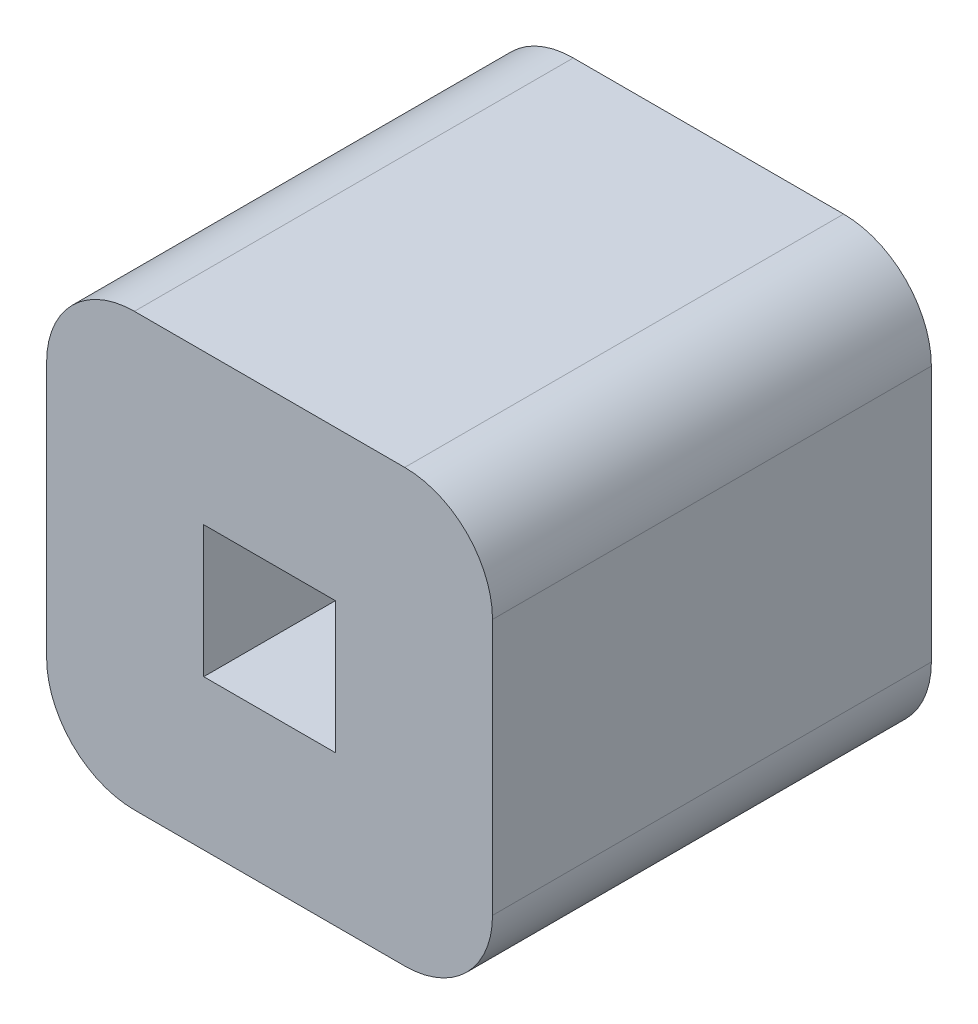
ISO-10303-21;
HEADER;
FILE_DESCRIPTION(('STEP AP214'),'2;1');
FILE_NAME('part.step','',(''),(''),'','','');
FILE_SCHEMA(('AUTOMOTIVE_DESIGN { 1 0 10303 214 1 1 1 1 }'));
ENDSEC;
DATA;
#1=APPLICATION_CONTEXT('core data for automotive mechanical design processes');
#2=APPLICATION_PROTOCOL_DEFINITION('international standard','automotive_design',2000,#1);
#3=PRODUCT_CONTEXT('',#1,'mechanical');
#4=PRODUCT('Part','Part','',(#3));
#5=PRODUCT_RELATED_PRODUCT_CATEGORY('part','',(#4));
#6=PRODUCT_DEFINITION_FORMATION('','',#4);
#7=PRODUCT_DEFINITION_CONTEXT('part definition',#1,'design');
#8=PRODUCT_DEFINITION('design','',#6,#7);
#9=PRODUCT_DEFINITION_SHAPE('','',#8);
#10=(LENGTH_UNIT() NAMED_UNIT(*) SI_UNIT(.MILLI.,.METRE.));
#11=(NAMED_UNIT(*) PLANE_ANGLE_UNIT() SI_UNIT($,.RADIAN.));
#12=(NAMED_UNIT(*) SI_UNIT($,.STERADIAN.) SOLID_ANGLE_UNIT());
#13=UNCERTAINTY_MEASURE_WITH_UNIT(LENGTH_MEASURE(1.E-05),#10,'distance_accuracy_value','');
#14=(GEOMETRIC_REPRESENTATION_CONTEXT(3) GLOBAL_UNCERTAINTY_ASSIGNED_CONTEXT((#13)) GLOBAL_UNIT_ASSIGNED_CONTEXT((#10,
#11,#12)) REPRESENTATION_CONTEXT('',''));
#15=CARTESIAN_POINT('',(0.,0.,0.));
#16=DIRECTION('',(0.,0.,1.));
#17=DIRECTION('',(1.,0.,0.));
#18=AXIS2_PLACEMENT_3D('',#15,#16,#17);
#19=CARTESIAN_POINT('',(0.570735714690618,-1.07588735959036,0.16337874015748));
#20=DIRECTION('',(0.,0.,-1.));
#21=DIRECTION('',(-1.,0.,0.));
#22=AXIS2_PLACEMENT_3D('',#19,#20,#21);
#23=PLANE('',#22);
#24=CARTESIAN_POINT('',(0.585420754060696,-0.946359800535238,0.16337874015748));
#25=DIRECTION('',(0.,0.,1.));
#26=DIRECTION('',(1.,0.,0.));
#27=AXIS2_PLACEMENT_3D('',#24,#25,#26);
#28=CIRCLE('',#27,0.0196850393700787);
#29=CARTESIAN_POINT('',(0.585420754060696,-0.966044839905316,0.16337874015748));
#30=VERTEX_POINT('',#29);
#31=CARTESIAN_POINT('',(0.565735714690617,-0.946359800535238,0.16337874015748));
#32=VERTEX_POINT('',#31);
#33=EDGE_CURVE('E159',#30,#32,#28,.F.);
#34=ORIENTED_EDGE('',*,*,#33,.F.);
#35=DIRECTION('',(1.,0.,0.));
#36=VECTOR('',#35,1.);
#37=CARTESIAN_POINT('',(0.649082171383531,-0.966044839905316,0.16337874015748));
#38=LINE('',#37,#36);
#39=CARTESIAN_POINT('',(0.646050675320538,-0.966044839905316,0.16337874015748));
#40=VERTEX_POINT('',#39);
#41=EDGE_CURVE('E134',#30,#40,#38,.T.);
#42=ORIENTED_EDGE('',*,*,#41,.T.);
#43=CARTESIAN_POINT('',(0.646050675320538,-0.946359800535238,0.16337874015748));
#44=DIRECTION('',(0.,0.,1.));
#45=DIRECTION('',(1.,0.,0.));
#46=AXIS2_PLACEMENT_3D('',#43,#44,#45);
#47=CIRCLE('',#46,0.0196850393700787);
#48=CARTESIAN_POINT('',(0.665735714690617,-0.946359800535238,0.16337874015748));
#49=VERTEX_POINT('',#48);
#50=EDGE_CURVE('E137',#49,#40,#47,.F.);
#51=ORIENTED_EDGE('',*,*,#50,.F.);
#52=DIRECTION('',(0.,1.,0.));
#53=VECTOR('',#52,1.);
#54=CARTESIAN_POINT('',(0.665735714690617,-0.781005469826576,0.16337874015748));
#55=LINE('',#54,#53);
#56=CARTESIAN_POINT('',(0.665735714690617,-0.888879485574608,0.16337874015748));
#57=VERTEX_POINT('',#56);
#58=EDGE_CURVE('E138',#49,#57,#55,.T.);
#59=ORIENTED_EDGE('',*,*,#58,.T.);
#60=CARTESIAN_POINT('',(0.646050675320538,-0.888879485574608,0.16337874015748));
#61=DIRECTION('',(0.,0.,-1.));
#62=DIRECTION('',(-1.,0.,0.));
#63=AXIS2_PLACEMENT_3D('',#60,#61,#62);
#64=CIRCLE('',#63,0.0196850393700787);
#65=CARTESIAN_POINT('',(0.646050675320538,-0.869194446204529,0.16337874015748));
#66=VERTEX_POINT('',#65);
#67=EDGE_CURVE('E164',#66,#57,#64,.T.);
#68=ORIENTED_EDGE('',*,*,#67,.F.);
#69=DIRECTION('',(1.,0.,0.));
#70=VECTOR('',#69,1.);
#71=CARTESIAN_POINT('',(0.649082171383531,-0.869194446204529,0.16337874015748));
#72=LINE('',#71,#70);
#73=CARTESIAN_POINT('',(0.585420754060696,-0.869194446204529,0.16337874015748));
#74=VERTEX_POINT('',#73);
#75=EDGE_CURVE('E143',#74,#66,#72,.T.);
#76=ORIENTED_EDGE('',*,*,#75,.F.);
#77=CARTESIAN_POINT('',(0.585420754060696,-0.888879485574608,0.16337874015748));
#78=DIRECTION('',(0.,0.,-1.));
#79=DIRECTION('',(-1.,0.,0.));
#80=AXIS2_PLACEMENT_3D('',#77,#78,#79);
#81=CIRCLE('',#80,0.0196850393700787);
#82=CARTESIAN_POINT('',(0.565735714690617,-0.888879485574608,0.16337874015748));
#83=VERTEX_POINT('',#82);
#84=EDGE_CURVE('E20',#83,#74,#81,.T.);
#85=ORIENTED_EDGE('',*,*,#84,.F.);
#86=DIRECTION('',(0.,1.,0.));
#87=VECTOR('',#86,1.);
#88=CARTESIAN_POINT('',(0.565735714690617,-0.917619643054923,0.16337874015748));
#89=LINE('',#88,#87);
#90=EDGE_CURVE('E84',#83,#32,#89,.F.);
#91=ORIENTED_EDGE('',*,*,#90,.T.);
#92=EDGE_LOOP('',(#34,#42,#51,#59,#68,#76,#85,#91));
#93=FACE_BOUND('',#92,.T.);
#94=DIRECTION('',(0.,1.,0.));
#95=VECTOR('',#94,1.);
#96=CARTESIAN_POINT('',(0.600971935163058,-0.901379485574608,0.16337874015748));
#97=LINE('',#96,#95);
#98=CARTESIAN_POINT('',(0.600971935163058,-0.932383422582482,0.16337874015748));
#99=VERTEX_POINT('',#98);
#100=CARTESIAN_POINT('',(0.600971935163058,-0.902855863527364,0.16337874015748));
#101=VERTEX_POINT('',#100);
#102=EDGE_CURVE('E94',#99,#101,#97,.T.);
#103=ORIENTED_EDGE('',*,*,#102,.T.);
#104=DIRECTION('',(1.,0.,0.));
#105=VECTOR('',#104,1.);
#106=CARTESIAN_POINT('',(0.599495557210302,-0.902855863527364,0.16337874015748));
#107=LINE('',#106,#105);
#108=CARTESIAN_POINT('',(0.630499494218177,-0.902855863527364,0.16337874015748));
#109=VERTEX_POINT('',#108);
#110=EDGE_CURVE('E110',#109,#101,#107,.F.);
#111=ORIENTED_EDGE('',*,*,#110,.F.);
#112=DIRECTION('',(0.,1.,0.));
#113=VECTOR('',#112,1.);
#114=CARTESIAN_POINT('',(0.630499494218177,-0.933859800535238,0.16337874015748));
#115=LINE('',#114,#113);
#116=CARTESIAN_POINT('',(0.630499494218177,-0.932383422582482,0.16337874015748));
#117=VERTEX_POINT('',#116);
#118=EDGE_CURVE('E106',#109,#117,#115,.F.);
#119=ORIENTED_EDGE('',*,*,#118,.T.);
#120=DIRECTION('',(1.,0.,0.));
#121=VECTOR('',#120,1.);
#122=CARTESIAN_POINT('',(0.599495557210302,-0.932383422582482,0.16337874015748));
#123=LINE('',#122,#121);
#124=EDGE_CURVE('E108',#117,#99,#123,.F.);
#125=ORIENTED_EDGE('',*,*,#124,.T.);
#126=EDGE_LOOP('',(#103,#111,#119,#125));
#127=FACE_BOUND('',#126,.T.);
#128=ADVANCED_FACE('F17',(#93,#127),#23,.F.);
#129=CARTESIAN_POINT('',(0.599495557210302,-0.932383422582482,0.152158267716535));
#130=DIRECTION('',(0.,-1.,0.));
#131=DIRECTION('',(0.,0.,-1.));
#132=AXIS2_PLACEMENT_3D('',#129,#130,#131);
#133=PLANE('',#132);
#134=DIRECTION('',(0.,0.,1.));
#135=VECTOR('',#134,1.);
#136=CARTESIAN_POINT('',(0.600971935163058,-0.932383422582482,0.152158267716535));
#137=LINE('',#136,#135);
#138=CARTESIAN_POINT('',(0.600971935163058,-0.932383422582482,0.0649535433070866));
#139=VERTEX_POINT('',#138);
#140=EDGE_CURVE('E120',#139,#99,#137,.T.);
#141=ORIENTED_EDGE('',*,*,#140,.T.);
#142=ORIENTED_EDGE('',*,*,#124,.F.);
#143=DIRECTION('',(0.,0.,-1.));
#144=VECTOR('',#143,1.);
#145=CARTESIAN_POINT('',(0.630499494218177,-0.932383422582482,0.152158267716535));
#146=LINE('',#145,#144);
#147=CARTESIAN_POINT('',(0.630499494218177,-0.932383422582482,0.0649535433070866));
#148=VERTEX_POINT('',#147);
#149=EDGE_CURVE('E112',#117,#148,#146,.T.);
#150=ORIENTED_EDGE('',*,*,#149,.T.);
#151=DIRECTION('',(-1.,0.,0.));
#152=VECTOR('',#151,1.);
#153=CARTESIAN_POINT('',(0.570735714690618,-0.932383422582482,0.0649535433070866));
#154=LINE('',#153,#152);
#155=EDGE_CURVE('E197',#139,#148,#154,.F.);
#156=ORIENTED_EDGE('',*,*,#155,.F.);
#157=EDGE_LOOP('',(#141,#142,#150,#156));
#158=FACE_BOUND('',#157,.T.);
#159=ADVANCED_FACE('F116',(#158),#133,.F.);
#160=CARTESIAN_POINT('',(0.630499494218177,-0.933859800535238,0.152158267716535));
#161=DIRECTION('',(1.,0.,0.));
#162=DIRECTION('',(0.,0.,-1.));
#163=AXIS2_PLACEMENT_3D('',#160,#161,#162);
#164=PLANE('',#163);
#165=ORIENTED_EDGE('',*,*,#149,.F.);
#166=ORIENTED_EDGE('',*,*,#118,.F.);
#167=DIRECTION('',(0.,0.,-1.));
#168=VECTOR('',#167,1.);
#169=CARTESIAN_POINT('',(0.630499494218177,-0.902855863527364,0.152158267716535));
#170=LINE('',#169,#168);
#171=CARTESIAN_POINT('',(0.630499494218177,-0.902855863527364,0.0649535433070866));
#172=VERTEX_POINT('',#171);
#173=EDGE_CURVE('E126',#172,#109,#170,.F.);
#174=ORIENTED_EDGE('',*,*,#173,.F.);
#175=DIRECTION('',(0.,1.,0.));
#176=VECTOR('',#175,1.);
#177=CARTESIAN_POINT('',(0.630499494218177,-1.07588735959036,0.0649535433070866));
#178=LINE('',#177,#176);
#179=EDGE_CURVE('E124',#148,#172,#178,.T.);
#180=ORIENTED_EDGE('',*,*,#179,.F.);
#181=EDGE_LOOP('',(#165,#166,#174,#180));
#182=FACE_BOUND('',#181,.T.);
#183=ADVANCED_FACE('F122',(#182),#164,.F.);
#184=CARTESIAN_POINT('',(0.599495557210302,-0.902855863527364,0.152158267716535));
#185=DIRECTION('',(0.,-1.,0.));
#186=DIRECTION('',(0.,0.,-1.));
#187=AXIS2_PLACEMENT_3D('',#184,#185,#186);
#188=PLANE('',#187);
#189=ORIENTED_EDGE('',*,*,#110,.T.);
#190=DIRECTION('',(0.,0.,1.));
#191=VECTOR('',#190,1.);
#192=CARTESIAN_POINT('',(0.600971935163058,-0.902855863527364,0.152158267716535));
#193=LINE('',#192,#191);
#194=CARTESIAN_POINT('',(0.600971935163058,-0.902855863527364,0.0649535433070866));
#195=VERTEX_POINT('',#194);
#196=EDGE_CURVE('E133',#101,#195,#193,.F.);
#197=ORIENTED_EDGE('',*,*,#196,.T.);
#198=DIRECTION('',(-1.,0.,0.));
#199=VECTOR('',#198,1.);
#200=CARTESIAN_POINT('',(0.570735714690618,-0.902855863527364,0.0649535433070866));
#201=LINE('',#200,#199);
#202=EDGE_CURVE('E193',#172,#195,#201,.T.);
#203=ORIENTED_EDGE('',*,*,#202,.F.);
#204=ORIENTED_EDGE('',*,*,#173,.T.);
#205=EDGE_LOOP('',(#189,#197,#203,#204));
#206=FACE_BOUND('',#205,.T.);
#207=ADVANCED_FACE('F182',(#206),#188,.T.);
#208=CARTESIAN_POINT('',(0.600971935163058,-0.901379485574608,0.152158267716535));
#209=DIRECTION('',(-1.,0.,0.));
#210=DIRECTION('',(0.,0.,1.));
#211=AXIS2_PLACEMENT_3D('',#208,#209,#210);
#212=PLANE('',#211);
#213=ORIENTED_EDGE('',*,*,#196,.F.);
#214=ORIENTED_EDGE('',*,*,#102,.F.);
#215=ORIENTED_EDGE('',*,*,#140,.F.);
#216=DIRECTION('',(0.,1.,0.));
#217=VECTOR('',#216,1.);
#218=CARTESIAN_POINT('',(0.600971935163058,-1.07588735959036,0.0649535433070866));
#219=LINE('',#218,#217);
#220=EDGE_CURVE('E188',#195,#139,#219,.F.);
#221=ORIENTED_EDGE('',*,*,#220,.F.);
#222=EDGE_LOOP('',(#213,#214,#215,#221));
#223=FACE_BOUND('',#222,.T.);
#224=ADVANCED_FACE('F186',(#223),#212,.F.);
#225=CARTESIAN_POINT('',(0.565735714690617,-0.917619643054923,0.114166141732283));
#226=DIRECTION('',(1.,0.,0.));
#227=DIRECTION('',(0.,1.,0.));
#228=AXIS2_PLACEMENT_3D('',#225,#226,#227);
#229=PLANE('',#228);
#230=DIRECTION('',(0.,0.,1.));
#231=VECTOR('',#230,1.);
#232=CARTESIAN_POINT('',(0.565735714690617,-0.946359800535238,0.1683));
#233=LINE('',#232,#231);
#234=CARTESIAN_POINT('',(0.565735714690617,-0.946359800535238,0.0649535433070866));
#235=VERTEX_POINT('',#234);
#236=EDGE_CURVE('E162',#32,#235,#233,.F.);
#237=ORIENTED_EDGE('',*,*,#236,.F.);
#238=ORIENTED_EDGE('',*,*,#90,.F.);
#239=DIRECTION('',(0.,0.,-1.));
#240=VECTOR('',#239,1.);
#241=CARTESIAN_POINT('',(0.565735714690617,-0.888879485574608,0.1683));
#242=LINE('',#241,#240);
#243=CARTESIAN_POINT('',(0.565735714690617,-0.888879485574608,0.0649535433070866));
#244=VERTEX_POINT('',#243);
#245=EDGE_CURVE('E132',#244,#83,#242,.F.);
#246=ORIENTED_EDGE('',*,*,#245,.F.);
#247=DIRECTION('',(0.,1.,0.));
#248=VECTOR('',#247,1.);
#249=CARTESIAN_POINT('',(0.565735714690617,-1.07588735959036,0.0649535433070866));
#250=LINE('',#249,#248);
#251=EDGE_CURVE('E158',#235,#244,#250,.T.);
#252=ORIENTED_EDGE('',*,*,#251,.F.);
#253=EDGE_LOOP('',(#237,#238,#246,#252));
#254=FACE_BOUND('',#253,.T.);
#255=ADVANCED_FACE('F227',(#254),#229,.F.);
#256=CARTESIAN_POINT('',(0.585420754060696,-0.888879485574608,0.1683));
#257=DIRECTION('',(0.,0.,-1.));
#258=DIRECTION('',(-1.,0.,0.));
#259=AXIS2_PLACEMENT_3D('',#256,#257,#258);
#260=CYLINDRICAL_SURFACE('',#259,0.0196850393700787);
#261=ORIENTED_EDGE('',*,*,#84,.T.);
#262=DIRECTION('',(0.,0.,1.));
#263=VECTOR('',#262,1.);
#264=CARTESIAN_POINT('',(0.585420754060696,-0.869194446204529,0.0600322834645669));
#265=LINE('',#264,#263);
#266=CARTESIAN_POINT('',(0.585420754060696,-0.869194446204529,0.0649535433070866));
#267=VERTEX_POINT('',#266);
#268=EDGE_CURVE('E145',#267,#74,#265,.T.);
#269=ORIENTED_EDGE('',*,*,#268,.F.);
#270=CARTESIAN_POINT('',(0.585420754060696,-0.888879485574608,0.0649535433070866));
#271=DIRECTION('',(0.,0.,-1.));
#272=DIRECTION('',(-1.,0.,0.));
#273=AXIS2_PLACEMENT_3D('',#270,#271,#272);
#274=CIRCLE('',#273,0.0196850393700787);
#275=EDGE_CURVE('E155',#244,#267,#274,.T.);
#276=ORIENTED_EDGE('',*,*,#275,.F.);
#277=ORIENTED_EDGE('',*,*,#245,.T.);
#278=EDGE_LOOP('',(#261,#269,#276,#277));
#279=FACE_BOUND('',#278,.T.);
#280=ADVANCED_FACE('F250',(#279),#260,.T.);
#281=CARTESIAN_POINT('',(0.649082171383531,-0.869194446204529,0.0600322834645669));
#282=DIRECTION('',(0.,1.,0.));
#283=DIRECTION('',(0.,0.,1.));
#284=AXIS2_PLACEMENT_3D('',#281,#282,#283);
#285=PLANE('',#284);
#286=ORIENTED_EDGE('',*,*,#75,.T.);
#287=DIRECTION('',(0.,0.,-1.));
#288=VECTOR('',#287,1.);
#289=CARTESIAN_POINT('',(0.646050675320538,-0.869194446204529,0.1683));
#290=LINE('',#289,#288);
#291=CARTESIAN_POINT('',(0.646050675320538,-0.869194446204529,0.0649535433070866));
#292=VERTEX_POINT('',#291);
#293=EDGE_CURVE('E144',#292,#66,#290,.F.);
#294=ORIENTED_EDGE('',*,*,#293,.F.);
#295=DIRECTION('',(-1.,0.,0.));
#296=VECTOR('',#295,1.);
#297=CARTESIAN_POINT('',(0.570735714690618,-0.869194446204529,0.0649535433070866));
#298=LINE('',#297,#296);
#299=EDGE_CURVE('E154',#267,#292,#298,.F.);
#300=ORIENTED_EDGE('',*,*,#299,.F.);
#301=ORIENTED_EDGE('',*,*,#268,.T.);
#302=EDGE_LOOP('',(#286,#294,#300,#301));
#303=FACE_BOUND('',#302,.T.);
#304=ADVANCED_FACE('F247',(#303),#285,.T.);
#305=CARTESIAN_POINT('',(0.646050675320538,-0.888879485574608,0.1683));
#306=DIRECTION('',(0.,0.,-1.));
#307=DIRECTION('',(-1.,0.,0.));
#308=AXIS2_PLACEMENT_3D('',#305,#306,#307);
#309=CYLINDRICAL_SURFACE('',#308,0.0196850393700787);
#310=ORIENTED_EDGE('',*,*,#67,.T.);
#311=DIRECTION('',(0.,0.,1.));
#312=VECTOR('',#311,1.);
#313=CARTESIAN_POINT('',(0.665735714690617,-0.888879485574608,0.0600322834645669));
#314=LINE('',#313,#312);
#315=CARTESIAN_POINT('',(0.665735714690617,-0.888879485574608,0.0649535433070866));
#316=VERTEX_POINT('',#315);
#317=EDGE_CURVE('E142',#57,#316,#314,.F.);
#318=ORIENTED_EDGE('',*,*,#317,.T.);
#319=CARTESIAN_POINT('',(0.646050675320538,-0.888879485574608,0.0649535433070866));
#320=DIRECTION('',(0.,0.,-1.));
#321=DIRECTION('',(-1.,0.,0.));
#322=AXIS2_PLACEMENT_3D('',#319,#320,#321);
#323=CIRCLE('',#322,0.0196850393700787);
#324=EDGE_CURVE('E151',#292,#316,#323,.T.);
#325=ORIENTED_EDGE('',*,*,#324,.F.);
#326=ORIENTED_EDGE('',*,*,#293,.T.);
#327=EDGE_LOOP('',(#310,#318,#325,#326));
#328=FACE_BOUND('',#327,.T.);
#329=ADVANCED_FACE('F244',(#328),#309,.T.);
#330=CARTESIAN_POINT('',(0.665735714690617,-0.781005469826576,0.0600322834645669));
#331=DIRECTION('',(-1.,0.,0.));
#332=DIRECTION('',(0.,0.,1.));
#333=AXIS2_PLACEMENT_3D('',#330,#331,#332);
#334=PLANE('',#333);
#335=DIRECTION('',(0.,0.,1.));
#336=VECTOR('',#335,1.);
#337=CARTESIAN_POINT('',(0.665735714690617,-0.946359800535238,0.1683));
#338=LINE('',#337,#336);
#339=CARTESIAN_POINT('',(0.665735714690617,-0.946359800535238,0.0649535433070866));
#340=VERTEX_POINT('',#339);
#341=EDGE_CURVE('E141',#340,#49,#338,.T.);
#342=ORIENTED_EDGE('',*,*,#341,.F.);
#343=DIRECTION('',(0.,1.,0.));
#344=VECTOR('',#343,1.);
#345=CARTESIAN_POINT('',(0.665735714690617,-1.07588735959036,0.0649535433070866));
#346=LINE('',#345,#344);
#347=EDGE_CURVE('E150',#316,#340,#346,.F.);
#348=ORIENTED_EDGE('',*,*,#347,.F.);
#349=ORIENTED_EDGE('',*,*,#317,.F.);
#350=ORIENTED_EDGE('',*,*,#58,.F.);
#351=EDGE_LOOP('',(#342,#348,#349,#350));
#352=FACE_BOUND('',#351,.T.);
#353=ADVANCED_FACE('F214',(#352),#334,.F.);
#354=CARTESIAN_POINT('',(0.646050675320538,-0.946359800535238,0.1683));
#355=DIRECTION('',(0.,0.,1.));
#356=DIRECTION('',(1.,0.,0.));
#357=AXIS2_PLACEMENT_3D('',#354,#355,#356);
#358=CYLINDRICAL_SURFACE('',#357,0.0196850393700787);
#359=ORIENTED_EDGE('',*,*,#50,.T.);
#360=DIRECTION('',(0.,0.,1.));
#361=VECTOR('',#360,1.);
#362=CARTESIAN_POINT('',(0.646050675320538,-0.966044839905316,0.0600322834645669));
#363=LINE('',#362,#361);
#364=CARTESIAN_POINT('',(0.646050675320538,-0.966044839905316,0.0649535433070866));
#365=VERTEX_POINT('',#364);
#366=EDGE_CURVE('E136',#40,#365,#363,.F.);
#367=ORIENTED_EDGE('',*,*,#366,.T.);
#368=CARTESIAN_POINT('',(0.646050675320538,-0.946359800535238,0.0649535433070866));
#369=DIRECTION('',(0.,0.,1.));
#370=DIRECTION('',(1.,0.,0.));
#371=AXIS2_PLACEMENT_3D('',#368,#369,#370);
#372=CIRCLE('',#371,0.0196850393700787);
#373=EDGE_CURVE('E147',#340,#365,#372,.F.);
#374=ORIENTED_EDGE('',*,*,#373,.F.);
#375=ORIENTED_EDGE('',*,*,#341,.T.);
#376=EDGE_LOOP('',(#359,#367,#374,#375));
#377=FACE_BOUND('',#376,.T.);
#378=ADVANCED_FACE('F208',(#377),#358,.T.);
#379=CARTESIAN_POINT('',(0.649082171383531,-0.966044839905316,0.0600322834645669));
#380=DIRECTION('',(0.,1.,0.));
#381=DIRECTION('',(0.,0.,1.));
#382=AXIS2_PLACEMENT_3D('',#379,#380,#381);
#383=PLANE('',#382);
#384=ORIENTED_EDGE('',*,*,#366,.F.);
#385=ORIENTED_EDGE('',*,*,#41,.F.);
#386=DIRECTION('',(0.,0.,1.));
#387=VECTOR('',#386,1.);
#388=CARTESIAN_POINT('',(0.585420754060696,-0.966044839905317,0.1683));
#389=LINE('',#388,#387);
#390=CARTESIAN_POINT('',(0.585420754060696,-0.966044839905316,0.0649535433070866));
#391=VERTEX_POINT('',#390);
#392=EDGE_CURVE('E35',#391,#30,#389,.T.);
#393=ORIENTED_EDGE('',*,*,#392,.F.);
#394=DIRECTION('',(-1.,0.,0.));
#395=VECTOR('',#394,1.);
#396=CARTESIAN_POINT('',(0.570735714690618,-0.966044839905316,0.0649535433070866));
#397=LINE('',#396,#395);
#398=EDGE_CURVE('E26',#365,#391,#397,.T.);
#399=ORIENTED_EDGE('',*,*,#398,.F.);
#400=EDGE_LOOP('',(#384,#385,#393,#399));
#401=FACE_BOUND('',#400,.T.);
#402=ADVANCED_FACE('F218',(#401),#383,.F.);
#403=CARTESIAN_POINT('',(0.585420754060696,-0.946359800535238,0.1683));
#404=DIRECTION('',(0.,0.,1.));
#405=DIRECTION('',(1.,0.,0.));
#406=AXIS2_PLACEMENT_3D('',#403,#404,#405);
#407=CYLINDRICAL_SURFACE('',#406,0.0196850393700787);
#408=ORIENTED_EDGE('',*,*,#33,.T.);
#409=ORIENTED_EDGE('',*,*,#236,.T.);
#410=CARTESIAN_POINT('',(0.585420754060696,-0.946359800535238,0.0649535433070866));
#411=DIRECTION('',(0.,0.,1.));
#412=DIRECTION('',(1.,0.,0.));
#413=AXIS2_PLACEMENT_3D('',#410,#411,#412);
#414=CIRCLE('',#413,0.0196850393700787);
#415=EDGE_CURVE('E11',#391,#235,#414,.F.);
#416=ORIENTED_EDGE('',*,*,#415,.F.);
#417=ORIENTED_EDGE('',*,*,#392,.T.);
#418=EDGE_LOOP('',(#408,#409,#416,#417));
#419=FACE_BOUND('',#418,.T.);
#420=ADVANCED_FACE('F229',(#419),#407,.T.);
#421=CARTESIAN_POINT('',(0.570735714690618,-1.07588735959036,0.0649535433070866));
#422=DIRECTION('',(0.,0.,-1.));
#423=DIRECTION('',(-1.,0.,0.));
#424=AXIS2_PLACEMENT_3D('',#421,#422,#423);
#425=PLANE('',#424);
#426=ORIENTED_EDGE('',*,*,#398,.T.);
#427=ORIENTED_EDGE('',*,*,#415,.T.);
#428=ORIENTED_EDGE('',*,*,#251,.T.);
#429=ORIENTED_EDGE('',*,*,#275,.T.);
#430=ORIENTED_EDGE('',*,*,#299,.T.);
#431=ORIENTED_EDGE('',*,*,#324,.T.);
#432=ORIENTED_EDGE('',*,*,#347,.T.);
#433=ORIENTED_EDGE('',*,*,#373,.T.);
#434=EDGE_LOOP('',(#426,#427,#428,#429,#430,#431,#432,#433));
#435=FACE_BOUND('',#434,.T.);
#436=ORIENTED_EDGE('',*,*,#202,.T.);
#437=ORIENTED_EDGE('',*,*,#220,.T.);
#438=ORIENTED_EDGE('',*,*,#155,.T.);
#439=ORIENTED_EDGE('',*,*,#179,.T.);
#440=EDGE_LOOP('',(#436,#437,#438,#439));
#441=FACE_BOUND('',#440,.T.);
#442=ADVANCED_FACE('F195',(#435,#441),#425,.T.);
#443=CLOSED_SHELL('',(#128,#159,#183,#207,#224,#255,#280,#304,#329,#353,#378,#402,#420,#442));
#444=MANIFOLD_SOLID_BREP('B1',#443);
#445=ADVANCED_BREP_SHAPE_REPRESENTATION('',(#18,#444),#14);
#446=SHAPE_DEFINITION_REPRESENTATION(#9,#445);
ENDSEC;
END-ISO-10303-21;
